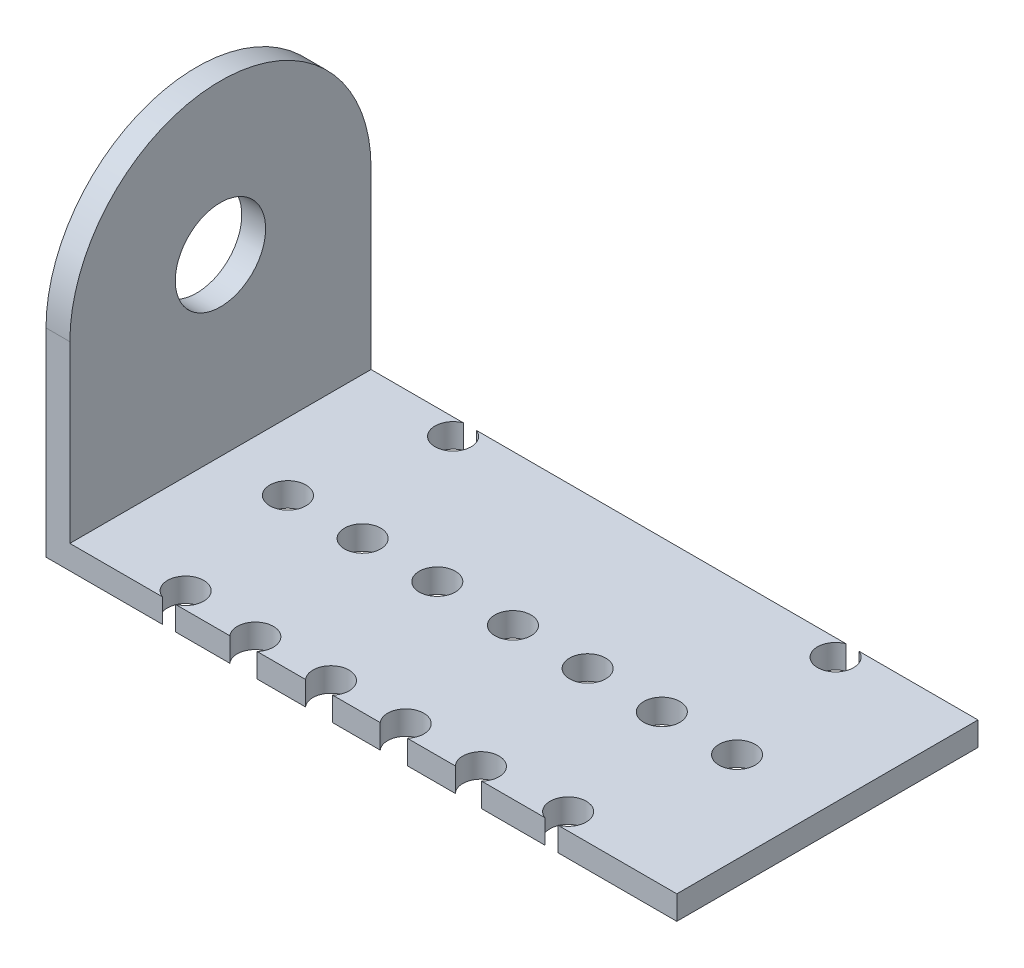
ISO-10303-21;
HEADER;
FILE_DESCRIPTION(('STEP AP214'),'2;1');
FILE_NAME('part.step','',(''),(''),'','','');
FILE_SCHEMA(('AUTOMOTIVE_DESIGN { 1 0 10303 214 1 1 1 1 }'));
ENDSEC;
DATA;
#1=APPLICATION_CONTEXT('core data for automotive mechanical design processes');
#2=APPLICATION_PROTOCOL_DEFINITION('international standard','automotive_design',2000,#1);
#3=PRODUCT_CONTEXT('',#1,'mechanical');
#4=PRODUCT('Part','Part','',(#3));
#5=PRODUCT_RELATED_PRODUCT_CATEGORY('part','',(#4));
#6=PRODUCT_DEFINITION_FORMATION('','',#4);
#7=PRODUCT_DEFINITION_CONTEXT('part definition',#1,'design');
#8=PRODUCT_DEFINITION('design','',#6,#7);
#9=PRODUCT_DEFINITION_SHAPE('','',#8);
#10=(LENGTH_UNIT() NAMED_UNIT(*) SI_UNIT(.MILLI.,.METRE.));
#11=(NAMED_UNIT(*) PLANE_ANGLE_UNIT() SI_UNIT($,.RADIAN.));
#12=(NAMED_UNIT(*) SI_UNIT($,.STERADIAN.) SOLID_ANGLE_UNIT());
#13=UNCERTAINTY_MEASURE_WITH_UNIT(LENGTH_MEASURE(1.E-05),#10,'distance_accuracy_value','');
#14=(GEOMETRIC_REPRESENTATION_CONTEXT(3) GLOBAL_UNCERTAINTY_ASSIGNED_CONTEXT((#13)) GLOBAL_UNIT_ASSIGNED_CONTEXT((#10,
#11,#12)) REPRESENTATION_CONTEXT('',''));
#15=CARTESIAN_POINT('',(0.,0.,0.));
#16=DIRECTION('',(0.,0.,1.));
#17=DIRECTION('',(1.,0.,0.));
#18=AXIS2_PLACEMENT_3D('',#15,#16,#17);
#19=CARTESIAN_POINT('',(0.,1.98,12.5));
#20=DIRECTION('',(0.,0.,1.));
#21=DIRECTION('',(1.,0.,0.));
#22=AXIS2_PLACEMENT_3D('',#19,#20,#21);
#23=PLANE('',#22);
#24=DIRECTION('',(-1.,0.,0.));
#25=VECTOR('',#24,1.);
#26=CARTESIAN_POINT('',(0.,0.,12.5));
#27=LINE('',#26,#25);
#28=CARTESIAN_POINT('',(15.221653010812,0.,12.5));
#29=VERTEX_POINT('',#28);
#30=CARTESIAN_POINT('',(9.98099619585551,0.,12.5));
#31=VERTEX_POINT('',#30);
#32=EDGE_CURVE('E262',#29,#31,#27,.T.);
#33=ORIENTED_EDGE('',*,*,#32,.F.);
#34=DIRECTION('',(0.,-1.,0.));
#35=VECTOR('',#34,1.);
#36=CARTESIAN_POINT('',(15.221653010812,1.98,12.5));
#37=LINE('',#36,#35);
#38=CARTESIAN_POINT('',(15.221653010812,1.98,12.5));
#39=VERTEX_POINT('',#38);
#40=EDGE_CURVE('E11',#39,#29,#37,.T.);
#41=ORIENTED_EDGE('',*,*,#40,.F.);
#42=DIRECTION('',(-1.,0.,0.));
#43=VECTOR('',#42,1.);
#44=CARTESIAN_POINT('',(0.,1.98,12.5));
#45=LINE('',#44,#43);
#46=CARTESIAN_POINT('',(9.98099619585551,1.98,12.5));
#47=VERTEX_POINT('',#46);
#48=EDGE_CURVE('E205',#39,#47,#45,.T.);
#49=ORIENTED_EDGE('',*,*,#48,.T.);
#50=DIRECTION('',(0.,-1.,0.));
#51=VECTOR('',#50,1.);
#52=CARTESIAN_POINT('',(9.98099619585551,1.98,12.5));
#53=LINE('',#52,#51);
#54=EDGE_CURVE('E129',#47,#31,#53,.T.);
#55=ORIENTED_EDGE('',*,*,#54,.T.);
#56=EDGE_LOOP('',(#33,#41,#49,#55));
#57=FACE_BOUND('',#56,.T.);
#58=ADVANCED_FACE('F35',(#57),#23,.T.);
#59=CARTESIAN_POINT('',(15.7601694915254,1.98,11.1));
#60=DIRECTION('',(0.,-1.,0.));
#61=DIRECTION('',(0.,0.,-1.));
#62=AXIS2_PLACEMENT_3D('',#59,#60,#61);
#63=CYLINDRICAL_SURFACE('',#62,1.5);
#64=CARTESIAN_POINT('',(15.7601694915254,0.,11.1));
#65=DIRECTION('',(0.,1.,0.));
#66=DIRECTION('',(0.,0.,1.));
#67=AXIS2_PLACEMENT_3D('',#64,#65,#66);
#68=CIRCLE('',#67,1.5);
#69=CARTESIAN_POINT('',(16.2986859722389,0.,12.5));
#70=VERTEX_POINT('',#69);
#71=EDGE_CURVE('E265',#29,#70,#68,.F.);
#72=ORIENTED_EDGE('',*,*,#71,.T.);
#73=DIRECTION('',(0.,-1.,0.));
#74=VECTOR('',#73,1.);
#75=CARTESIAN_POINT('',(16.2986859722389,1.98,12.5));
#76=LINE('',#75,#74);
#77=CARTESIAN_POINT('',(16.2986859722389,1.98,12.5));
#78=VERTEX_POINT('',#77);
#79=EDGE_CURVE('E44',#78,#70,#76,.T.);
#80=ORIENTED_EDGE('',*,*,#79,.F.);
#81=CARTESIAN_POINT('',(15.7601694915254,1.98,11.1));
#82=DIRECTION('',(0.,1.,0.));
#83=DIRECTION('',(0.,0.,1.));
#84=AXIS2_PLACEMENT_3D('',#81,#82,#83);
#85=CIRCLE('',#84,1.5);
#86=EDGE_CURVE('E212',#39,#78,#85,.F.);
#87=ORIENTED_EDGE('',*,*,#86,.F.);
#88=ORIENTED_EDGE('',*,*,#40,.T.);
#89=EDGE_LOOP('',(#72,#80,#87,#88));
#90=FACE_BOUND('',#89,.T.);
#91=ADVANCED_FACE('F441',(#90),#63,.F.);
#92=CARTESIAN_POINT('',(26.18,0.,12.5));
#93=VERTEX_POINT('',#92);
#94=EDGE_CURVE('E267',#93,#70,#27,.T.);
#95=ORIENTED_EDGE('',*,*,#94,.F.);
#96=DIRECTION('',(0.,-1.,0.));
#97=VECTOR('',#96,1.);
#98=CARTESIAN_POINT('',(26.18,1.98,12.5));
#99=LINE('',#98,#97);
#100=CARTESIAN_POINT('',(26.18,1.98,12.5));
#101=VERTEX_POINT('',#100);
#102=EDGE_CURVE('E334',#101,#93,#99,.T.);
#103=ORIENTED_EDGE('',*,*,#102,.F.);
#104=EDGE_CURVE('E214',#101,#78,#45,.T.);
#105=ORIENTED_EDGE('',*,*,#104,.T.);
#106=ORIENTED_EDGE('',*,*,#79,.T.);
#107=EDGE_LOOP('',(#95,#103,#105,#106));
#108=FACE_BOUND('',#107,.T.);
#109=ADVANCED_FACE('F443',(#108),#23,.T.);
#110=CARTESIAN_POINT('',(26.18,1.98,0.));
#111=DIRECTION('',(-1.,0.,0.));
#112=DIRECTION('',(0.,0.,1.));
#113=AXIS2_PLACEMENT_3D('',#110,#111,#112);
#114=PLANE('',#113);
#115=DIRECTION('',(0.,0.,-1.));
#116=VECTOR('',#115,1.);
#117=CARTESIAN_POINT('',(26.18,0.,0.));
#118=LINE('',#117,#116);
#119=CARTESIAN_POINT('',(26.18,0.,-12.5));
#120=VERTEX_POINT('',#119);
#121=EDGE_CURVE('E270',#93,#120,#118,.T.);
#122=ORIENTED_EDGE('',*,*,#121,.T.);
#123=DIRECTION('',(0.,-1.,0.));
#124=VECTOR('',#123,1.);
#125=CARTESIAN_POINT('',(26.18,1.98,-12.5));
#126=LINE('',#125,#124);
#127=CARTESIAN_POINT('',(26.18,1.98,-12.5));
#128=VERTEX_POINT('',#127);
#129=EDGE_CURVE('E331',#128,#120,#126,.T.);
#130=ORIENTED_EDGE('',*,*,#129,.F.);
#131=DIRECTION('',(0.,0.,-1.));
#132=VECTOR('',#131,1.);
#133=CARTESIAN_POINT('',(26.18,1.98,0.));
#134=LINE('',#133,#132);
#135=EDGE_CURVE('E218',#101,#128,#134,.T.);
#136=ORIENTED_EDGE('',*,*,#135,.F.);
#137=ORIENTED_EDGE('',*,*,#102,.T.);
#138=EDGE_LOOP('',(#122,#130,#136,#137));
#139=FACE_BOUND('',#138,.T.);
#140=ADVANCED_FACE('F451',(#139),#114,.F.);
#141=CARTESIAN_POINT('',(0.,1.98,-12.5));
#142=DIRECTION('',(0.,0.,1.));
#143=DIRECTION('',(1.,0.,0.));
#144=AXIS2_PLACEMENT_3D('',#141,#142,#143);
#145=PLANE('',#144);
#146=DIRECTION('',(-1.,0.,0.));
#147=VECTOR('',#146,1.);
#148=CARTESIAN_POINT('',(0.,0.,-12.5));
#149=LINE('',#148,#147);
#150=CARTESIAN_POINT('',(16.2986859722389,0.,-12.5));
#151=VERTEX_POINT('',#150);
#152=EDGE_CURVE('E273',#120,#151,#149,.T.);
#153=ORIENTED_EDGE('',*,*,#152,.T.);
#154=DIRECTION('',(0.,-1.,0.));
#155=VECTOR('',#154,1.);
#156=CARTESIAN_POINT('',(16.2986859722389,1.98,-12.5));
#157=LINE('',#156,#155);
#158=CARTESIAN_POINT('',(16.2986859722389,1.98,-12.5));
#159=VERTEX_POINT('',#158);
#160=EDGE_CURVE('E329',#159,#151,#157,.T.);
#161=ORIENTED_EDGE('',*,*,#160,.F.);
#162=DIRECTION('',(-1.,0.,0.));
#163=VECTOR('',#162,1.);
#164=CARTESIAN_POINT('',(0.,1.98,-12.5));
#165=LINE('',#164,#163);
#166=EDGE_CURVE('E223',#128,#159,#165,.T.);
#167=ORIENTED_EDGE('',*,*,#166,.F.);
#168=ORIENTED_EDGE('',*,*,#129,.T.);
#169=EDGE_LOOP('',(#153,#161,#167,#168));
#170=FACE_BOUND('',#169,.T.);
#171=ADVANCED_FACE('F590',(#170),#145,.F.);
#172=CARTESIAN_POINT('',(15.7601694915254,1.98,-11.1));
#173=DIRECTION('',(0.,-1.,0.));
#174=DIRECTION('',(0.,0.,-1.));
#175=AXIS2_PLACEMENT_3D('',#172,#173,#174);
#176=CYLINDRICAL_SURFACE('',#175,1.5);
#177=CARTESIAN_POINT('',(15.7601694915254,0.,-11.1));
#178=DIRECTION('',(0.,1.,0.));
#179=DIRECTION('',(0.,0.,1.));
#180=AXIS2_PLACEMENT_3D('',#177,#178,#179);
#181=CIRCLE('',#180,1.5);
#182=CARTESIAN_POINT('',(15.221653010812,0.,-12.5));
#183=VERTEX_POINT('',#182);
#184=EDGE_CURVE('E276',#183,#151,#181,.T.);
#185=ORIENTED_EDGE('',*,*,#184,.F.);
#186=DIRECTION('',(0.,-1.,0.));
#187=VECTOR('',#186,1.);
#188=CARTESIAN_POINT('',(15.221653010812,1.98,-12.5));
#189=LINE('',#188,#187);
#190=CARTESIAN_POINT('',(15.221653010812,1.98,-12.5));
#191=VERTEX_POINT('',#190);
#192=EDGE_CURVE('E327',#191,#183,#189,.T.);
#193=ORIENTED_EDGE('',*,*,#192,.F.);
#194=CARTESIAN_POINT('',(15.7601694915254,1.98,-11.1));
#195=DIRECTION('',(0.,1.,0.));
#196=DIRECTION('',(0.,0.,1.));
#197=AXIS2_PLACEMENT_3D('',#194,#195,#196);
#198=CIRCLE('',#197,1.5);
#199=EDGE_CURVE('E344',#191,#159,#198,.T.);
#200=ORIENTED_EDGE('',*,*,#199,.T.);
#201=ORIENTED_EDGE('',*,*,#160,.T.);
#202=EDGE_LOOP('',(#185,#193,#200,#201));
#203=FACE_BOUND('',#202,.T.);
#204=ADVANCED_FACE('F755',(#203),#176,.F.);
#205=CARTESIAN_POINT('',(-15.4513140277611,0.,-12.5));
#206=VERTEX_POINT('',#205);
#207=EDGE_CURVE('E278',#183,#206,#149,.T.);
#208=ORIENTED_EDGE('',*,*,#207,.T.);
#209=DIRECTION('',(0.,-1.,0.));
#210=VECTOR('',#209,1.);
#211=CARTESIAN_POINT('',(-15.4513140277611,1.98,-12.5));
#212=LINE('',#211,#210);
#213=CARTESIAN_POINT('',(-15.4513140277611,1.98,-12.5));
#214=VERTEX_POINT('',#213);
#215=EDGE_CURVE('E325',#214,#206,#212,.T.);
#216=ORIENTED_EDGE('',*,*,#215,.F.);
#217=EDGE_CURVE('E345',#191,#214,#165,.T.);
#218=ORIENTED_EDGE('',*,*,#217,.F.);
#219=ORIENTED_EDGE('',*,*,#192,.T.);
#220=EDGE_LOOP('',(#208,#216,#218,#219));
#221=FACE_BOUND('',#220,.T.);
#222=ADVANCED_FACE('F356',(#221),#145,.F.);
#223=CARTESIAN_POINT('',(-15.9898305084746,1.98,-11.1));
#224=DIRECTION('',(0.,-1.,0.));
#225=DIRECTION('',(0.,0.,-1.));
#226=AXIS2_PLACEMENT_3D('',#223,#224,#225);
#227=CYLINDRICAL_SURFACE('',#226,1.5);
#228=CARTESIAN_POINT('',(-15.9898305084746,0.,-11.1));
#229=DIRECTION('',(0.,1.,0.));
#230=DIRECTION('',(0.,0.,1.));
#231=AXIS2_PLACEMENT_3D('',#228,#229,#230);
#232=CIRCLE('',#231,1.5);
#233=CARTESIAN_POINT('',(-16.528346989188,0.,-12.5));
#234=VERTEX_POINT('',#233);
#235=EDGE_CURVE('E281',#234,#206,#232,.T.);
#236=ORIENTED_EDGE('',*,*,#235,.F.);
#237=DIRECTION('',(0.,-1.,0.));
#238=VECTOR('',#237,1.);
#239=CARTESIAN_POINT('',(-16.528346989188,1.98,-12.5));
#240=LINE('',#239,#238);
#241=CARTESIAN_POINT('',(-16.528346989188,1.98,-12.5));
#242=VERTEX_POINT('',#241);
#243=EDGE_CURVE('E323',#242,#234,#240,.T.);
#244=ORIENTED_EDGE('',*,*,#243,.F.);
#245=CARTESIAN_POINT('',(-15.9898305084746,1.98,-11.1));
#246=DIRECTION('',(0.,1.,0.));
#247=DIRECTION('',(0.,0.,1.));
#248=AXIS2_PLACEMENT_3D('',#245,#246,#247);
#249=CIRCLE('',#248,1.5);
#250=EDGE_CURVE('E340',#242,#214,#249,.T.);
#251=ORIENTED_EDGE('',*,*,#250,.T.);
#252=ORIENTED_EDGE('',*,*,#215,.T.);
#253=EDGE_LOOP('',(#236,#244,#251,#252));
#254=FACE_BOUND('',#253,.T.);
#255=ADVANCED_FACE('F359',(#254),#227,.F.);
#256=CARTESIAN_POINT('',(-26.18,0.,-12.5));
#257=VERTEX_POINT('',#256);
#258=EDGE_CURVE('E277',#234,#257,#149,.T.);
#259=ORIENTED_EDGE('',*,*,#258,.T.);
#260=DIRECTION('',(0.,-1.,0.));
#261=VECTOR('',#260,1.);
#262=CARTESIAN_POINT('',(-26.18,1.98,-12.5));
#263=LINE('',#262,#261);
#264=CARTESIAN_POINT('',(-26.18,16.48,-12.5));
#265=VERTEX_POINT('',#264);
#266=EDGE_CURVE('E321',#265,#257,#263,.T.);
#267=ORIENTED_EDGE('',*,*,#266,.F.);
#268=DIRECTION('',(-1.,0.,0.));
#269=VECTOR('',#268,1.);
#270=CARTESIAN_POINT('',(-26.18,16.48,-12.5));
#271=LINE('',#270,#269);
#272=CARTESIAN_POINT('',(-24.2,16.48,-12.5));
#273=VERTEX_POINT('',#272);
#274=EDGE_CURVE('E387',#273,#265,#271,.T.);
#275=ORIENTED_EDGE('',*,*,#274,.F.);
#276=DIRECTION('',(0.,-1.,0.));
#277=VECTOR('',#276,1.);
#278=CARTESIAN_POINT('',(-24.2,16.48,-12.5));
#279=LINE('',#278,#277);
#280=CARTESIAN_POINT('',(-24.2,1.98,-12.5));
#281=VERTEX_POINT('',#280);
#282=EDGE_CURVE('E375',#273,#281,#279,.T.);
#283=ORIENTED_EDGE('',*,*,#282,.T.);
#284=EDGE_CURVE('E337',#242,#281,#165,.T.);
#285=ORIENTED_EDGE('',*,*,#284,.F.);
#286=ORIENTED_EDGE('',*,*,#243,.T.);
#287=EDGE_LOOP('',(#259,#267,#275,#283,#285,#286));
#288=FACE_BOUND('',#287,.T.);
#289=ADVANCED_FACE('F370',(#288),#145,.F.);
#290=CARTESIAN_POINT('',(-26.18,1.98,0.));
#291=DIRECTION('',(-1.,0.,0.));
#292=DIRECTION('',(0.,0.,1.));
#293=AXIS2_PLACEMENT_3D('',#290,#291,#292);
#294=PLANE('',#293);
#295=CARTESIAN_POINT('',(-26.18,16.48,0.));
#296=DIRECTION('',(-1.,0.,0.));
#297=DIRECTION('',(0.,0.,1.));
#298=AXIS2_PLACEMENT_3D('',#295,#296,#297);
#299=CIRCLE('',#298,3.75);
#300=CARTESIAN_POINT('',(-26.18,16.48,3.75));
#301=VERTEX_POINT('',#300);
#302=EDGE_CURVE('E637',#301,#301,#299,.T.);
#303=ORIENTED_EDGE('',*,*,#302,.F.);
#304=EDGE_LOOP('',(#303));
#305=FACE_BOUND('',#304,.T.);
#306=DIRECTION('',(0.,-1.,0.));
#307=VECTOR('',#306,1.);
#308=CARTESIAN_POINT('',(-26.18,1.98,12.5));
#309=LINE('',#308,#307);
#310=CARTESIAN_POINT('',(-26.18,16.48,12.5));
#311=VERTEX_POINT('',#310);
#312=CARTESIAN_POINT('',(-26.18,0.,12.5));
#313=VERTEX_POINT('',#312);
#314=EDGE_CURVE('E319',#311,#313,#309,.T.);
#315=ORIENTED_EDGE('',*,*,#314,.F.);
#316=CARTESIAN_POINT('',(-26.18,16.48,0.));
#317=DIRECTION('',(-1.,0.,0.));
#318=DIRECTION('',(0.,0.,1.));
#319=AXIS2_PLACEMENT_3D('',#316,#317,#318);
#320=CIRCLE('',#319,12.5);
#321=EDGE_CURVE('E389',#311,#265,#320,.T.);
#322=ORIENTED_EDGE('',*,*,#321,.T.);
#323=ORIENTED_EDGE('',*,*,#266,.T.);
#324=DIRECTION('',(0.,0.,-1.));
#325=VECTOR('',#324,1.);
#326=CARTESIAN_POINT('',(-26.18,0.,0.));
#327=LINE('',#326,#325);
#328=EDGE_CURVE('E284',#313,#257,#327,.T.);
#329=ORIENTED_EDGE('',*,*,#328,.F.);
#330=EDGE_LOOP('',(#315,#322,#323,#329));
#331=FACE_BOUND('',#330,.T.);
#332=ADVANCED_FACE('F486',(#305,#331),#294,.T.);
#333=CARTESIAN_POINT('',(-16.528346989188,0.,12.5));
#334=VERTEX_POINT('',#333);
#335=EDGE_CURVE('E287',#334,#313,#27,.T.);
#336=ORIENTED_EDGE('',*,*,#335,.F.);
#337=DIRECTION('',(0.,-1.,0.));
#338=VECTOR('',#337,1.);
#339=CARTESIAN_POINT('',(-16.528346989188,1.98,12.5));
#340=LINE('',#339,#338);
#341=CARTESIAN_POINT('',(-16.528346989188,1.98,12.5));
#342=VERTEX_POINT('',#341);
#343=EDGE_CURVE('E317',#342,#334,#340,.T.);
#344=ORIENTED_EDGE('',*,*,#343,.F.);
#345=CARTESIAN_POINT('',(-24.2,1.98,12.5));
#346=VERTEX_POINT('',#345);
#347=EDGE_CURVE('E231',#342,#346,#45,.T.);
#348=ORIENTED_EDGE('',*,*,#347,.T.);
#349=DIRECTION('',(0.,-1.,0.));
#350=VECTOR('',#349,1.);
#351=CARTESIAN_POINT('',(-24.2,16.48,12.5));
#352=LINE('',#351,#350);
#353=CARTESIAN_POINT('',(-24.2,16.48,12.5));
#354=VERTEX_POINT('',#353);
#355=EDGE_CURVE('E244',#354,#346,#352,.T.);
#356=ORIENTED_EDGE('',*,*,#355,.F.);
#357=DIRECTION('',(1.,0.,0.));
#358=VECTOR('',#357,1.);
#359=CARTESIAN_POINT('',(-26.18,16.48,12.5));
#360=LINE('',#359,#358);
#361=EDGE_CURVE('E384',#311,#354,#360,.T.);
#362=ORIENTED_EDGE('',*,*,#361,.F.);
#363=ORIENTED_EDGE('',*,*,#314,.T.);
#364=EDGE_LOOP('',(#336,#344,#348,#356,#362,#363));
#365=FACE_BOUND('',#364,.T.);
#366=ADVANCED_FACE('F452',(#365),#23,.T.);
#367=CARTESIAN_POINT('',(-15.9898305084746,1.98,11.1));
#368=DIRECTION('',(0.,-1.,0.));
#369=DIRECTION('',(0.,0.,-1.));
#370=AXIS2_PLACEMENT_3D('',#367,#368,#369);
#371=CYLINDRICAL_SURFACE('',#370,1.5);
#372=CARTESIAN_POINT('',(-15.9898305084746,0.,11.1));
#373=DIRECTION('',(0.,1.,0.));
#374=DIRECTION('',(0.,0.,1.));
#375=AXIS2_PLACEMENT_3D('',#372,#373,#374);
#376=CIRCLE('',#375,1.5);
#377=CARTESIAN_POINT('',(-15.4513140277611,0.,12.5));
#378=VERTEX_POINT('',#377);
#379=EDGE_CURVE('E288',#334,#378,#376,.F.);
#380=ORIENTED_EDGE('',*,*,#379,.T.);
#381=DIRECTION('',(0.,-1.,0.));
#382=VECTOR('',#381,1.);
#383=CARTESIAN_POINT('',(-15.4513140277611,1.98,12.5));
#384=LINE('',#383,#382);
#385=CARTESIAN_POINT('',(-15.4513140277611,1.98,12.5));
#386=VERTEX_POINT('',#385);
#387=EDGE_CURVE('E315',#386,#378,#384,.T.);
#388=ORIENTED_EDGE('',*,*,#387,.F.);
#389=CARTESIAN_POINT('',(-15.9898305084746,1.98,11.1));
#390=DIRECTION('',(0.,1.,0.));
#391=DIRECTION('',(0.,0.,1.));
#392=AXIS2_PLACEMENT_3D('',#389,#390,#391);
#393=CIRCLE('',#392,1.5);
#394=EDGE_CURVE('E227',#342,#386,#393,.F.);
#395=ORIENTED_EDGE('',*,*,#394,.F.);
#396=ORIENTED_EDGE('',*,*,#343,.T.);
#397=EDGE_LOOP('',(#380,#388,#395,#396));
#398=FACE_BOUND('',#397,.T.);
#399=ADVANCED_FACE('F478',(#398),#371,.F.);
#400=CARTESIAN_POINT('',(-10.9208952661552,0.,12.5));
#401=VERTEX_POINT('',#400);
#402=EDGE_CURVE('E291',#401,#378,#27,.T.);
#403=ORIENTED_EDGE('',*,*,#402,.F.);
#404=DIRECTION('',(0.,-1.,0.));
#405=VECTOR('',#404,1.);
#406=CARTESIAN_POINT('',(-10.9208952661552,1.98,12.5));
#407=LINE('',#406,#405);
#408=CARTESIAN_POINT('',(-10.9208952661552,1.98,12.5));
#409=VERTEX_POINT('',#408);
#410=EDGE_CURVE('E313',#409,#401,#407,.T.);
#411=ORIENTED_EDGE('',*,*,#410,.F.);
#412=EDGE_CURVE('E219',#409,#386,#45,.T.);
#413=ORIENTED_EDGE('',*,*,#412,.T.);
#414=ORIENTED_EDGE('',*,*,#387,.T.);
#415=EDGE_LOOP('',(#403,#411,#413,#414));
#416=FACE_BOUND('',#415,.T.);
#417=ADVANCED_FACE('F470',(#416),#23,.T.);
#418=CARTESIAN_POINT('',(-9.78983050847457,1.98,11.5147627118644));
#419=DIRECTION('',(0.,-1.,0.));
#420=DIRECTION('',(0.,0.,-1.));
#421=AXIS2_PLACEMENT_3D('',#418,#419,#420);
#422=CYLINDRICAL_SURFACE('',#421,1.5);
#423=CARTESIAN_POINT('',(-9.78983050847457,0.,11.5147627118644));
#424=DIRECTION('',(0.,1.,0.));
#425=DIRECTION('',(0.,0.,1.));
#426=AXIS2_PLACEMENT_3D('',#423,#424,#425);
#427=CIRCLE('',#426,1.5);
#428=CARTESIAN_POINT('',(-8.65876575079391,0.,12.5));
#429=VERTEX_POINT('',#428);
#430=EDGE_CURVE('E292',#401,#429,#427,.F.);
#431=ORIENTED_EDGE('',*,*,#430,.T.);
#432=DIRECTION('',(0.,-1.,0.));
#433=VECTOR('',#432,1.);
#434=CARTESIAN_POINT('',(-8.65876575079391,1.98,12.5));
#435=LINE('',#434,#433);
#436=CARTESIAN_POINT('',(-8.65876575079391,1.98,12.5));
#437=VERTEX_POINT('',#436);
#438=EDGE_CURVE('E311',#437,#429,#435,.T.);
#439=ORIENTED_EDGE('',*,*,#438,.F.);
#440=CARTESIAN_POINT('',(-9.78983050847457,1.98,11.5147627118644));
#441=DIRECTION('',(0.,1.,0.));
#442=DIRECTION('',(0.,0.,1.));
#443=AXIS2_PLACEMENT_3D('',#440,#441,#442);
#444=CIRCLE('',#443,1.5);
#445=EDGE_CURVE('E226',#409,#437,#444,.F.);
#446=ORIENTED_EDGE('',*,*,#445,.F.);
#447=ORIENTED_EDGE('',*,*,#410,.T.);
#448=EDGE_LOOP('',(#431,#439,#446,#447));
#449=FACE_BOUND('',#448,.T.);
#450=ADVANCED_FACE('F469',(#449),#422,.F.);
#451=CARTESIAN_POINT('',(-4.64089526615523,0.,12.5));
#452=VERTEX_POINT('',#451);
#453=EDGE_CURVE('E295',#452,#429,#27,.T.);
#454=ORIENTED_EDGE('',*,*,#453,.F.);
#455=DIRECTION('',(0.,-1.,0.));
#456=VECTOR('',#455,1.);
#457=CARTESIAN_POINT('',(-4.64089526615523,1.98,12.5));
#458=LINE('',#457,#456);
#459=CARTESIAN_POINT('',(-4.64089526615523,1.98,12.5));
#460=VERTEX_POINT('',#459);
#461=EDGE_CURVE('E309',#460,#452,#458,.T.);
#462=ORIENTED_EDGE('',*,*,#461,.F.);
#463=EDGE_CURVE('E211',#460,#437,#45,.T.);
#464=ORIENTED_EDGE('',*,*,#463,.T.);
#465=ORIENTED_EDGE('',*,*,#438,.T.);
#466=EDGE_LOOP('',(#454,#462,#464,#465));
#467=FACE_BOUND('',#466,.T.);
#468=ADVANCED_FACE('F461',(#467),#23,.T.);
#469=CARTESIAN_POINT('',(-3.50983050847457,1.98,11.5147627118644));
#470=DIRECTION('',(0.,-1.,0.));
#471=DIRECTION('',(0.,0.,-1.));
#472=AXIS2_PLACEMENT_3D('',#469,#470,#471);
#473=CYLINDRICAL_SURFACE('',#472,1.5);
#474=CARTESIAN_POINT('',(-3.50983050847457,0.,11.5147627118644));
#475=DIRECTION('',(0.,1.,0.));
#476=DIRECTION('',(0.,0.,1.));
#477=AXIS2_PLACEMENT_3D('',#474,#475,#476);
#478=CIRCLE('',#477,1.5);
#479=CARTESIAN_POINT('',(-2.37876575079391,0.,12.5));
#480=VERTEX_POINT('',#479);
#481=EDGE_CURVE('E296',#452,#480,#478,.F.);
#482=ORIENTED_EDGE('',*,*,#481,.T.);
#483=DIRECTION('',(0.,-1.,0.));
#484=VECTOR('',#483,1.);
#485=CARTESIAN_POINT('',(-2.37876575079391,1.98,12.5));
#486=LINE('',#485,#484);
#487=CARTESIAN_POINT('',(-2.37876575079391,1.98,12.5));
#488=VERTEX_POINT('',#487);
#489=EDGE_CURVE('E307',#488,#480,#486,.T.);
#490=ORIENTED_EDGE('',*,*,#489,.F.);
#491=CARTESIAN_POINT('',(-3.50983050847457,1.98,11.5147627118644));
#492=DIRECTION('',(0.,1.,0.));
#493=DIRECTION('',(0.,0.,1.));
#494=AXIS2_PLACEMENT_3D('',#491,#492,#493);
#495=CIRCLE('',#494,1.5);
#496=EDGE_CURVE('E210',#460,#488,#495,.F.);
#497=ORIENTED_EDGE('',*,*,#496,.F.);
#498=ORIENTED_EDGE('',*,*,#461,.T.);
#499=EDGE_LOOP('',(#482,#490,#497,#498));
#500=FACE_BOUND('',#499,.T.);
#501=ADVANCED_FACE('F459',(#500),#473,.F.);
#502=CARTESIAN_POINT('',(1.55910473384476,0.,12.5));
#503=VERTEX_POINT('',#502);
#504=EDGE_CURVE('E299',#503,#480,#27,.T.);
#505=ORIENTED_EDGE('',*,*,#504,.F.);
#506=DIRECTION('',(0.,-1.,0.));
#507=VECTOR('',#506,1.);
#508=CARTESIAN_POINT('',(1.55910473384476,1.98,12.5));
#509=LINE('',#508,#507);
#510=CARTESIAN_POINT('',(1.55910473384476,1.98,12.5));
#511=VERTEX_POINT('',#510);
#512=EDGE_CURVE('E200',#511,#503,#509,.T.);
#513=ORIENTED_EDGE('',*,*,#512,.F.);
#514=EDGE_CURVE('E189',#511,#488,#45,.T.);
#515=ORIENTED_EDGE('',*,*,#514,.T.);
#516=ORIENTED_EDGE('',*,*,#489,.T.);
#517=EDGE_LOOP('',(#505,#513,#515,#516));
#518=FACE_BOUND('',#517,.T.);
#519=ADVANCED_FACE('F454',(#518),#23,.T.);
#520=CARTESIAN_POINT('',(2.69016949152543,1.98,11.5147627118644));
#521=DIRECTION('',(0.,-1.,0.));
#522=DIRECTION('',(0.,0.,-1.));
#523=AXIS2_PLACEMENT_3D('',#520,#521,#522);
#524=CYLINDRICAL_SURFACE('',#523,1.5);
#525=CARTESIAN_POINT('',(2.69016949152543,0.,11.5147627118644));
#526=DIRECTION('',(0.,1.,0.));
#527=DIRECTION('',(0.,0.,1.));
#528=AXIS2_PLACEMENT_3D('',#525,#526,#527);
#529=CIRCLE('',#528,1.5);
#530=CARTESIAN_POINT('',(3.82123424920609,0.,12.5));
#531=VERTEX_POINT('',#530);
#532=EDGE_CURVE('E196',#503,#531,#529,.F.);
#533=ORIENTED_EDGE('',*,*,#532,.T.);
#534=DIRECTION('',(0.,-1.,0.));
#535=VECTOR('',#534,1.);
#536=CARTESIAN_POINT('',(3.82123424920609,1.98,12.5));
#537=LINE('',#536,#535);
#538=CARTESIAN_POINT('',(3.82123424920609,1.98,12.5));
#539=VERTEX_POINT('',#538);
#540=EDGE_CURVE('E193',#539,#531,#537,.T.);
#541=ORIENTED_EDGE('',*,*,#540,.F.);
#542=CARTESIAN_POINT('',(2.69016949152543,1.98,11.5147627118644));
#543=DIRECTION('',(0.,1.,0.));
#544=DIRECTION('',(0.,0.,1.));
#545=AXIS2_PLACEMENT_3D('',#542,#543,#544);
#546=CIRCLE('',#545,1.5);
#547=EDGE_CURVE('E182',#511,#539,#546,.F.);
#548=ORIENTED_EDGE('',*,*,#547,.F.);
#549=ORIENTED_EDGE('',*,*,#512,.T.);
#550=EDGE_LOOP('',(#533,#541,#548,#549));
#551=FACE_BOUND('',#550,.T.);
#552=ADVANCED_FACE('F194',(#551),#524,.F.);
#553=CARTESIAN_POINT('',(7.79934278719535,0.,12.5));
#554=VERTEX_POINT('',#553);
#555=EDGE_CURVE('E266',#554,#531,#27,.T.);
#556=ORIENTED_EDGE('',*,*,#555,.F.);
#557=DIRECTION('',(0.,-1.,0.));
#558=VECTOR('',#557,1.);
#559=CARTESIAN_POINT('',(7.79934278719535,1.98,12.5));
#560=LINE('',#559,#558);
#561=CARTESIAN_POINT('',(7.79934278719535,1.98,12.5));
#562=VERTEX_POINT('',#561);
#563=EDGE_CURVE('E201',#562,#554,#560,.T.);
#564=ORIENTED_EDGE('',*,*,#563,.F.);
#565=EDGE_CURVE('E187',#562,#539,#45,.T.);
#566=ORIENTED_EDGE('',*,*,#565,.T.);
#567=ORIENTED_EDGE('',*,*,#540,.T.);
#568=EDGE_LOOP('',(#556,#564,#566,#567));
#569=FACE_BOUND('',#568,.T.);
#570=ADVANCED_FACE('F203',(#569),#23,.T.);
#571=CARTESIAN_POINT('',(18.68,1.98,0.));
#572=DIRECTION('',(0.,-1.,0.));
#573=DIRECTION('',(0.,0.,-1.));
#574=AXIS2_PLACEMENT_3D('',#571,#572,#573);
#575=CYLINDRICAL_SURFACE('',#574,1.5);
#576=CARTESIAN_POINT('',(18.68,1.98,0.));
#577=DIRECTION('',(0.,1.,0.));
#578=DIRECTION('',(0.,0.,1.));
#579=AXIS2_PLACEMENT_3D('',#576,#577,#578);
#580=CIRCLE('',#579,1.5);
#581=CARTESIAN_POINT('',(18.68,1.98,1.5));
#582=VERTEX_POINT('',#581);
#583=EDGE_CURVE('E213',#582,#582,#580,.T.);
#584=ORIENTED_EDGE('',*,*,#583,.T.);
#585=EDGE_LOOP('',(#584));
#586=FACE_BOUND('',#585,.T.);
#587=CARTESIAN_POINT('',(18.68,0.,0.));
#588=DIRECTION('',(0.,1.,0.));
#589=DIRECTION('',(0.,0.,1.));
#590=AXIS2_PLACEMENT_3D('',#587,#588,#589);
#591=CIRCLE('',#590,1.5);
#592=CARTESIAN_POINT('',(18.68,0.,1.5));
#593=VERTEX_POINT('',#592);
#594=EDGE_CURVE('E259',#593,#593,#591,.T.);
#595=ORIENTED_EDGE('',*,*,#594,.F.);
#596=EDGE_LOOP('',(#595));
#597=FACE_BOUND('',#596,.T.);
#598=ADVANCED_FACE('F423',(#586,#597),#575,.F.);
#599=CARTESIAN_POINT('',(12.48,1.98,0.0443728813559338));
#600=DIRECTION('',(0.,-1.,0.));
#601=DIRECTION('',(0.,0.,-1.));
#602=AXIS2_PLACEMENT_3D('',#599,#600,#601);
#603=CYLINDRICAL_SURFACE('',#602,1.5);
#604=CARTESIAN_POINT('',(12.48,1.98,0.0443728813559338));
#605=DIRECTION('',(0.,1.,0.));
#606=DIRECTION('',(0.,0.,1.));
#607=AXIS2_PLACEMENT_3D('',#604,#605,#606);
#608=CIRCLE('',#607,1.5);
#609=CARTESIAN_POINT('',(12.48,1.98,1.54437288135593));
#610=VERTEX_POINT('',#609);
#611=EDGE_CURVE('E216',#610,#610,#608,.T.);
#612=ORIENTED_EDGE('',*,*,#611,.T.);
#613=EDGE_LOOP('',(#612));
#614=FACE_BOUND('',#613,.T.);
#615=CARTESIAN_POINT('',(12.48,0.,0.0443728813559338));
#616=DIRECTION('',(0.,1.,0.));
#617=DIRECTION('',(0.,0.,1.));
#618=AXIS2_PLACEMENT_3D('',#615,#616,#617);
#619=CIRCLE('',#618,1.5);
#620=CARTESIAN_POINT('',(12.48,0.,1.54437288135593));
#621=VERTEX_POINT('',#620);
#622=EDGE_CURVE('E256',#621,#621,#619,.T.);
#623=ORIENTED_EDGE('',*,*,#622,.F.);
#624=EDGE_LOOP('',(#623));
#625=FACE_BOUND('',#624,.T.);
#626=ADVANCED_FACE('F414',(#614,#625),#603,.F.);
#627=CARTESIAN_POINT('',(6.28,1.98,0.));
#628=DIRECTION('',(0.,-1.,0.));
#629=DIRECTION('',(0.,0.,-1.));
#630=AXIS2_PLACEMENT_3D('',#627,#628,#629);
#631=CYLINDRICAL_SURFACE('',#630,1.5);
#632=CARTESIAN_POINT('',(6.28,1.98,0.));
#633=DIRECTION('',(0.,1.,0.));
#634=DIRECTION('',(0.,0.,1.));
#635=AXIS2_PLACEMENT_3D('',#632,#633,#634);
#636=CIRCLE('',#635,1.5);
#637=CARTESIAN_POINT('',(6.28,1.98,1.5));
#638=VERTEX_POINT('',#637);
#639=EDGE_CURVE('E408',#638,#638,#636,.T.);
#640=ORIENTED_EDGE('',*,*,#639,.T.);
#641=EDGE_LOOP('',(#640));
#642=FACE_BOUND('',#641,.T.);
#643=CARTESIAN_POINT('',(6.28,0.,0.));
#644=DIRECTION('',(0.,1.,0.));
#645=DIRECTION('',(0.,0.,1.));
#646=AXIS2_PLACEMENT_3D('',#643,#644,#645);
#647=CIRCLE('',#646,1.5);
#648=CARTESIAN_POINT('',(6.28,0.,1.5));
#649=VERTEX_POINT('',#648);
#650=EDGE_CURVE('E253',#649,#649,#647,.T.);
#651=ORIENTED_EDGE('',*,*,#650,.F.);
#652=EDGE_LOOP('',(#651));
#653=FACE_BOUND('',#652,.T.);
#654=ADVANCED_FACE('F530',(#642,#653),#631,.F.);
#655=CARTESIAN_POINT('',(0.0800000000000019,1.98,0.));
#656=DIRECTION('',(0.,-1.,0.));
#657=DIRECTION('',(0.,0.,-1.));
#658=AXIS2_PLACEMENT_3D('',#655,#656,#657);
#659=CYLINDRICAL_SURFACE('',#658,1.5);
#660=CARTESIAN_POINT('',(0.0800000000000019,1.98,0.));
#661=DIRECTION('',(0.,1.,0.));
#662=DIRECTION('',(0.,0.,1.));
#663=AXIS2_PLACEMENT_3D('',#660,#661,#662);
#664=CIRCLE('',#663,1.5);
#665=CARTESIAN_POINT('',(0.0800000000000019,1.98,1.5));
#666=VERTEX_POINT('',#665);
#667=EDGE_CURVE('E405',#666,#666,#664,.T.);
#668=ORIENTED_EDGE('',*,*,#667,.T.);
#669=EDGE_LOOP('',(#668));
#670=FACE_BOUND('',#669,.T.);
#671=CARTESIAN_POINT('',(0.0800000000000019,0.,0.));
#672=DIRECTION('',(0.,1.,0.));
#673=DIRECTION('',(0.,0.,1.));
#674=AXIS2_PLACEMENT_3D('',#671,#672,#673);
#675=CIRCLE('',#674,1.5);
#676=CARTESIAN_POINT('',(0.0800000000000019,0.,1.5));
#677=VERTEX_POINT('',#676);
#678=EDGE_CURVE('E250',#677,#677,#675,.T.);
#679=ORIENTED_EDGE('',*,*,#678,.F.);
#680=EDGE_LOOP('',(#679));
#681=FACE_BOUND('',#680,.T.);
#682=ADVANCED_FACE('F533',(#670,#681),#659,.F.);
#683=CARTESIAN_POINT('',(-6.2,1.98,0.));
#684=DIRECTION('',(0.,-1.,0.));
#685=DIRECTION('',(0.,0.,-1.));
#686=AXIS2_PLACEMENT_3D('',#683,#684,#685);
#687=CYLINDRICAL_SURFACE('',#686,1.5);
#688=CARTESIAN_POINT('',(-6.2,1.98,0.));
#689=DIRECTION('',(0.,1.,0.));
#690=DIRECTION('',(0.,0.,1.));
#691=AXIS2_PLACEMENT_3D('',#688,#689,#690);
#692=CIRCLE('',#691,1.5);
#693=CARTESIAN_POINT('',(-6.2,1.98,1.5));
#694=VERTEX_POINT('',#693);
#695=EDGE_CURVE('E402',#694,#694,#692,.T.);
#696=ORIENTED_EDGE('',*,*,#695,.T.);
#697=EDGE_LOOP('',(#696));
#698=FACE_BOUND('',#697,.T.);
#699=CARTESIAN_POINT('',(-6.2,0.,0.));
#700=DIRECTION('',(0.,1.,0.));
#701=DIRECTION('',(0.,0.,1.));
#702=AXIS2_PLACEMENT_3D('',#699,#700,#701);
#703=CIRCLE('',#702,1.5);
#704=CARTESIAN_POINT('',(-6.2,0.,1.5));
#705=VERTEX_POINT('',#704);
#706=EDGE_CURVE('E247',#705,#705,#703,.T.);
#707=ORIENTED_EDGE('',*,*,#706,.F.);
#708=EDGE_LOOP('',(#707));
#709=FACE_BOUND('',#708,.T.);
#710=ADVANCED_FACE('F516',(#698,#709),#687,.F.);
#711=CARTESIAN_POINT('',(-18.6,1.98,0.));
#712=DIRECTION('',(0.,-1.,0.));
#713=DIRECTION('',(0.,0.,-1.));
#714=AXIS2_PLACEMENT_3D('',#711,#712,#713);
#715=CYLINDRICAL_SURFACE('',#714,1.5);
#716=CARTESIAN_POINT('',(-18.6,1.98,0.));
#717=DIRECTION('',(0.,1.,0.));
#718=DIRECTION('',(0.,0.,1.));
#719=AXIS2_PLACEMENT_3D('',#716,#717,#718);
#720=CIRCLE('',#719,1.5);
#721=CARTESIAN_POINT('',(-18.6,1.98,1.50000000000001));
#722=VERTEX_POINT('',#721);
#723=EDGE_CURVE('E399',#722,#722,#720,.T.);
#724=ORIENTED_EDGE('',*,*,#723,.T.);
#725=EDGE_LOOP('',(#724));
#726=FACE_BOUND('',#725,.T.);
#727=CARTESIAN_POINT('',(-18.6,0.,0.));
#728=DIRECTION('',(0.,1.,0.));
#729=DIRECTION('',(0.,0.,1.));
#730=AXIS2_PLACEMENT_3D('',#727,#728,#729);
#731=CIRCLE('',#730,1.5);
#732=CARTESIAN_POINT('',(-18.6,0.,1.50000000000001));
#733=VERTEX_POINT('',#732);
#734=EDGE_CURVE('E243',#733,#733,#731,.T.);
#735=ORIENTED_EDGE('',*,*,#734,.F.);
#736=EDGE_LOOP('',(#735));
#737=FACE_BOUND('',#736,.T.);
#738=ADVANCED_FACE('F511',(#726,#737),#715,.F.);
#739=CARTESIAN_POINT('',(-12.4,1.98,0.));
#740=DIRECTION('',(0.,-1.,0.));
#741=DIRECTION('',(0.,0.,-1.));
#742=AXIS2_PLACEMENT_3D('',#739,#740,#741);
#743=CYLINDRICAL_SURFACE('',#742,1.5);
#744=CARTESIAN_POINT('',(-12.4,1.98,0.));
#745=DIRECTION('',(0.,1.,0.));
#746=DIRECTION('',(0.,0.,1.));
#747=AXIS2_PLACEMENT_3D('',#744,#745,#746);
#748=CIRCLE('',#747,1.5);
#749=CARTESIAN_POINT('',(-12.4,1.98,1.50000000000001));
#750=VERTEX_POINT('',#749);
#751=EDGE_CURVE('E303',#750,#750,#748,.T.);
#752=ORIENTED_EDGE('',*,*,#751,.T.);
#753=EDGE_LOOP('',(#752));
#754=FACE_BOUND('',#753,.T.);
#755=CARTESIAN_POINT('',(-12.4,0.,0.));
#756=DIRECTION('',(0.,1.,0.));
#757=DIRECTION('',(0.,0.,1.));
#758=AXIS2_PLACEMENT_3D('',#755,#756,#757);
#759=CIRCLE('',#758,1.5);
#760=CARTESIAN_POINT('',(-12.4,0.,1.50000000000001));
#761=VERTEX_POINT('',#760);
#762=EDGE_CURVE('E240',#761,#761,#759,.T.);
#763=ORIENTED_EDGE('',*,*,#762,.F.);
#764=EDGE_LOOP('',(#763));
#765=FACE_BOUND('',#764,.T.);
#766=ADVANCED_FACE('F37',(#754,#765),#743,.F.);
#767=CARTESIAN_POINT('',(8.89016949152543,1.98,11.4703898305085));
#768=DIRECTION('',(0.,-1.,0.));
#769=DIRECTION('',(0.,0.,-1.));
#770=AXIS2_PLACEMENT_3D('',#767,#768,#769);
#771=CYLINDRICAL_SURFACE('',#770,1.5);
#772=CARTESIAN_POINT('',(8.89016949152543,0.,11.4703898305085));
#773=DIRECTION('',(0.,1.,0.));
#774=DIRECTION('',(0.,0.,1.));
#775=AXIS2_PLACEMENT_3D('',#772,#773,#774);
#776=CIRCLE('',#775,1.5);
#777=EDGE_CURVE('E301',#554,#31,#776,.F.);
#778=ORIENTED_EDGE('',*,*,#777,.T.);
#779=ORIENTED_EDGE('',*,*,#54,.F.);
#780=CARTESIAN_POINT('',(8.89016949152543,1.98,11.4703898305085));
#781=DIRECTION('',(0.,1.,0.));
#782=DIRECTION('',(0.,0.,1.));
#783=AXIS2_PLACEMENT_3D('',#780,#781,#782);
#784=CIRCLE('',#783,1.5);
#785=EDGE_CURVE('E60',#562,#47,#784,.F.);
#786=ORIENTED_EDGE('',*,*,#785,.F.);
#787=ORIENTED_EDGE('',*,*,#563,.T.);
#788=EDGE_LOOP('',(#778,#779,#786,#787));
#789=FACE_BOUND('',#788,.T.);
#790=ADVANCED_FACE('F419',(#789),#771,.F.);
#791=CARTESIAN_POINT('',(0.,1.98,0.));
#792=DIRECTION('',(0.,1.,0.));
#793=DIRECTION('',(0.,0.,1.));
#794=AXIS2_PLACEMENT_3D('',#791,#792,#793);
#795=PLANE('',#794);
#796=DIRECTION('',(0.,0.,-1.));
#797=VECTOR('',#796,1.);
#798=CARTESIAN_POINT('',(-24.2,1.98,-12.5));
#799=LINE('',#798,#797);
#800=EDGE_CURVE('E52',#346,#281,#799,.T.);
#801=ORIENTED_EDGE('',*,*,#800,.F.);
#802=ORIENTED_EDGE('',*,*,#347,.F.);
#803=ORIENTED_EDGE('',*,*,#394,.T.);
#804=ORIENTED_EDGE('',*,*,#412,.F.);
#805=ORIENTED_EDGE('',*,*,#445,.T.);
#806=ORIENTED_EDGE('',*,*,#463,.F.);
#807=ORIENTED_EDGE('',*,*,#496,.T.);
#808=ORIENTED_EDGE('',*,*,#514,.F.);
#809=ORIENTED_EDGE('',*,*,#547,.T.);
#810=ORIENTED_EDGE('',*,*,#565,.F.);
#811=ORIENTED_EDGE('',*,*,#785,.T.);
#812=ORIENTED_EDGE('',*,*,#48,.F.);
#813=ORIENTED_EDGE('',*,*,#86,.T.);
#814=ORIENTED_EDGE('',*,*,#104,.F.);
#815=ORIENTED_EDGE('',*,*,#135,.T.);
#816=ORIENTED_EDGE('',*,*,#166,.T.);
#817=ORIENTED_EDGE('',*,*,#199,.F.);
#818=ORIENTED_EDGE('',*,*,#217,.T.);
#819=ORIENTED_EDGE('',*,*,#250,.F.);
#820=ORIENTED_EDGE('',*,*,#284,.T.);
#821=EDGE_LOOP('',(#801,#802,#803,#804,#805,#806,#807,#808,#809,#810,#811,#812,#813,#814,#815,
#816,#817,#818,#819,#820));
#822=FACE_BOUND('',#821,.T.);
#823=ORIENTED_EDGE('',*,*,#751,.F.);
#824=EDGE_LOOP('',(#823));
#825=FACE_BOUND('',#824,.T.);
#826=ORIENTED_EDGE('',*,*,#723,.F.);
#827=EDGE_LOOP('',(#826));
#828=FACE_BOUND('',#827,.T.);
#829=ORIENTED_EDGE('',*,*,#695,.F.);
#830=EDGE_LOOP('',(#829));
#831=FACE_BOUND('',#830,.T.);
#832=ORIENTED_EDGE('',*,*,#667,.F.);
#833=EDGE_LOOP('',(#832));
#834=FACE_BOUND('',#833,.T.);
#835=ORIENTED_EDGE('',*,*,#639,.F.);
#836=EDGE_LOOP('',(#835));
#837=FACE_BOUND('',#836,.T.);
#838=ORIENTED_EDGE('',*,*,#611,.F.);
#839=EDGE_LOOP('',(#838));
#840=FACE_BOUND('',#839,.T.);
#841=ORIENTED_EDGE('',*,*,#583,.F.);
#842=EDGE_LOOP('',(#841));
#843=FACE_BOUND('',#842,.T.);
#844=ADVANCED_FACE('F184',(#822,#825,#828,#831,#834,#837,#840,#843),#795,.T.);
#845=CARTESIAN_POINT('',(0.,0.,0.));
#846=DIRECTION('',(0.,1.,0.));
#847=DIRECTION('',(0.,0.,1.));
#848=AXIS2_PLACEMENT_3D('',#845,#846,#847);
#849=PLANE('',#848);
#850=ORIENTED_EDGE('',*,*,#762,.T.);
#851=EDGE_LOOP('',(#850));
#852=FACE_BOUND('',#851,.T.);
#853=ORIENTED_EDGE('',*,*,#734,.T.);
#854=EDGE_LOOP('',(#853));
#855=FACE_BOUND('',#854,.T.);
#856=ORIENTED_EDGE('',*,*,#706,.T.);
#857=EDGE_LOOP('',(#856));
#858=FACE_BOUND('',#857,.T.);
#859=ORIENTED_EDGE('',*,*,#678,.T.);
#860=EDGE_LOOP('',(#859));
#861=FACE_BOUND('',#860,.T.);
#862=ORIENTED_EDGE('',*,*,#650,.T.);
#863=EDGE_LOOP('',(#862));
#864=FACE_BOUND('',#863,.T.);
#865=ORIENTED_EDGE('',*,*,#622,.T.);
#866=EDGE_LOOP('',(#865));
#867=FACE_BOUND('',#866,.T.);
#868=ORIENTED_EDGE('',*,*,#594,.T.);
#869=EDGE_LOOP('',(#868));
#870=FACE_BOUND('',#869,.T.);
#871=ORIENTED_EDGE('',*,*,#32,.T.);
#872=ORIENTED_EDGE('',*,*,#777,.F.);
#873=ORIENTED_EDGE('',*,*,#555,.T.);
#874=ORIENTED_EDGE('',*,*,#532,.F.);
#875=ORIENTED_EDGE('',*,*,#504,.T.);
#876=ORIENTED_EDGE('',*,*,#481,.F.);
#877=ORIENTED_EDGE('',*,*,#453,.T.);
#878=ORIENTED_EDGE('',*,*,#430,.F.);
#879=ORIENTED_EDGE('',*,*,#402,.T.);
#880=ORIENTED_EDGE('',*,*,#379,.F.);
#881=ORIENTED_EDGE('',*,*,#335,.T.);
#882=ORIENTED_EDGE('',*,*,#328,.T.);
#883=ORIENTED_EDGE('',*,*,#258,.F.);
#884=ORIENTED_EDGE('',*,*,#235,.T.);
#885=ORIENTED_EDGE('',*,*,#207,.F.);
#886=ORIENTED_EDGE('',*,*,#184,.T.);
#887=ORIENTED_EDGE('',*,*,#152,.F.);
#888=ORIENTED_EDGE('',*,*,#121,.F.);
#889=ORIENTED_EDGE('',*,*,#94,.T.);
#890=ORIENTED_EDGE('',*,*,#71,.F.);
#891=EDGE_LOOP('',(#871,#872,#873,#874,#875,#876,#877,#878,#879,#880,#881,#882,#883,#884,#885,
#886,#887,#888,#889,#890));
#892=FACE_BOUND('',#891,.T.);
#893=ADVANCED_FACE('F363',(#852,#855,#858,#861,#864,#867,#870,#892),#849,.F.);
#894=CARTESIAN_POINT('',(-24.2,16.48,-12.5));
#895=DIRECTION('',(-1.,0.,0.));
#896=DIRECTION('',(0.,0.,1.));
#897=AXIS2_PLACEMENT_3D('',#894,#895,#896);
#898=PLANE('',#897);
#899=CARTESIAN_POINT('',(-24.2,16.48,0.));
#900=DIRECTION('',(-1.,0.,0.));
#901=DIRECTION('',(0.,0.,1.));
#902=AXIS2_PLACEMENT_3D('',#899,#900,#901);
#903=CIRCLE('',#902,3.75);
#904=CARTESIAN_POINT('',(-24.2,16.48,3.75));
#905=VERTEX_POINT('',#904);
#906=EDGE_CURVE('E39',#905,#905,#903,.T.);
#907=ORIENTED_EDGE('',*,*,#906,.T.);
#908=EDGE_LOOP('',(#907));
#909=FACE_BOUND('',#908,.T.);
#910=ORIENTED_EDGE('',*,*,#282,.F.);
#911=CARTESIAN_POINT('',(-24.2,16.48,0.));
#912=DIRECTION('',(-1.,0.,0.));
#913=DIRECTION('',(0.,0.,1.));
#914=AXIS2_PLACEMENT_3D('',#911,#912,#913);
#915=CIRCLE('',#914,12.5);
#916=EDGE_CURVE('E385',#273,#354,#915,.F.);
#917=ORIENTED_EDGE('',*,*,#916,.T.);
#918=ORIENTED_EDGE('',*,*,#355,.T.);
#919=ORIENTED_EDGE('',*,*,#800,.T.);
#920=EDGE_LOOP('',(#910,#917,#918,#919));
#921=FACE_BOUND('',#920,.T.);
#922=ADVANCED_FACE('F380',(#909,#921),#898,.F.);
#923=CARTESIAN_POINT('',(11.1553390593274,16.48,0.));
#924=DIRECTION('',(-1.,0.,0.));
#925=DIRECTION('',(0.,0.,1.));
#926=AXIS2_PLACEMENT_3D('',#923,#924,#925);
#927=CYLINDRICAL_SURFACE('',#926,12.5);
#928=ORIENTED_EDGE('',*,*,#916,.F.);
#929=ORIENTED_EDGE('',*,*,#274,.T.);
#930=ORIENTED_EDGE('',*,*,#321,.F.);
#931=ORIENTED_EDGE('',*,*,#361,.T.);
#932=EDGE_LOOP('',(#928,#929,#930,#931));
#933=FACE_BOUND('',#932,.T.);
#934=ADVANCED_FACE('F435',(#933),#927,.T.);
#935=CARTESIAN_POINT('',(-11.68,16.48,0.));
#936=DIRECTION('',(-1.,0.,0.));
#937=DIRECTION('',(0.,0.,1.));
#938=AXIS2_PLACEMENT_3D('',#935,#936,#937);
#939=CYLINDRICAL_SURFACE('',#938,3.75);
#940=ORIENTED_EDGE('',*,*,#302,.T.);
#941=EDGE_LOOP('',(#940));
#942=FACE_BOUND('',#941,.T.);
#943=ORIENTED_EDGE('',*,*,#906,.F.);
#944=EDGE_LOOP('',(#943));
#945=FACE_BOUND('',#944,.T.);
#946=ADVANCED_FACE('F608',(#942,#945),#939,.F.);
#947=CLOSED_SHELL('',(#58,#91,#109,#140,#171,#204,#222,#255,#289,#332,#366,#399,#417,#450,#468,
#501,#519,#552,#570,#598,#626,#654,#682,#710,#738,#766,#790,#844,#893,#922,#934,#946));
#948=MANIFOLD_SOLID_BREP('B2',#947);
#949=ADVANCED_BREP_SHAPE_REPRESENTATION('',(#18,#948),#14);
#950=SHAPE_DEFINITION_REPRESENTATION(#9,#949);
ENDSEC;
END-ISO-10303-21;
